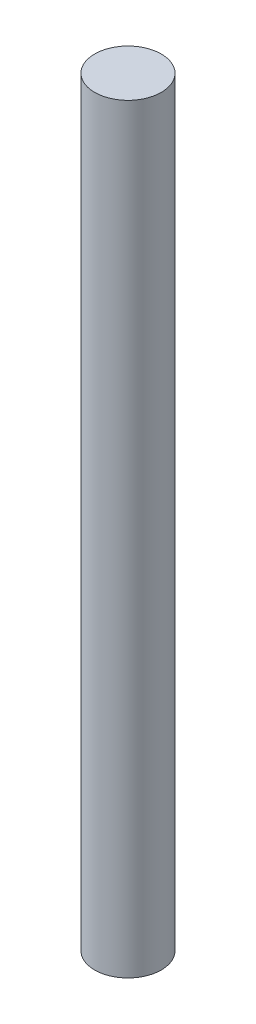
ISO-10303-21;
HEADER;
FILE_DESCRIPTION(('STEP AP214'),'2;1');
FILE_NAME('part.step','',(''),(''),'','','');
FILE_SCHEMA(('AUTOMOTIVE_DESIGN { 1 0 10303 214 1 1 1 1 }'));
ENDSEC;
DATA;
#1=APPLICATION_CONTEXT('core data for automotive mechanical design processes');
#2=APPLICATION_PROTOCOL_DEFINITION('international standard','automotive_design',2000,#1);
#3=PRODUCT_CONTEXT('',#1,'mechanical');
#4=PRODUCT('Part','Part','',(#3));
#5=PRODUCT_RELATED_PRODUCT_CATEGORY('part','',(#4));
#6=PRODUCT_DEFINITION_FORMATION('','',#4);
#7=PRODUCT_DEFINITION_CONTEXT('part definition',#1,'design');
#8=PRODUCT_DEFINITION('design','',#6,#7);
#9=PRODUCT_DEFINITION_SHAPE('','',#8);
#10=(LENGTH_UNIT() NAMED_UNIT(*) SI_UNIT(.MILLI.,.METRE.));
#11=(NAMED_UNIT(*) PLANE_ANGLE_UNIT() SI_UNIT($,.RADIAN.));
#12=(NAMED_UNIT(*) SI_UNIT($,.STERADIAN.) SOLID_ANGLE_UNIT());
#13=UNCERTAINTY_MEASURE_WITH_UNIT(LENGTH_MEASURE(1.E-05),#10,'distance_accuracy_value','');
#14=(GEOMETRIC_REPRESENTATION_CONTEXT(3) GLOBAL_UNCERTAINTY_ASSIGNED_CONTEXT((#13)) GLOBAL_UNIT_ASSIGNED_CONTEXT((#10,
#11,#12)) REPRESENTATION_CONTEXT('',''));
#15=CARTESIAN_POINT('',(0.,0.,0.));
#16=DIRECTION('',(0.,0.,1.));
#17=DIRECTION('',(1.,0.,0.));
#18=AXIS2_PLACEMENT_3D('',#15,#16,#17);
#19=CARTESIAN_POINT('',(0.,290.,0.));
#20=DIRECTION('',(0.,-1.,0.));
#21=DIRECTION('',(0.,0.,-1.));
#22=AXIS2_PLACEMENT_3D('',#19,#20,#21);
#23=CYLINDRICAL_SURFACE('',#22,12.7);
#24=CARTESIAN_POINT('',(0.,290.,0.));
#25=DIRECTION('',(0.,1.,0.));
#26=DIRECTION('',(0.,0.,1.));
#27=AXIS2_PLACEMENT_3D('',#24,#25,#26);
#28=CIRCLE('',#27,12.7);
#29=CARTESIAN_POINT('',(0.,290.,12.7));
#30=VERTEX_POINT('',#29);
#31=EDGE_CURVE('E10',#30,#30,#28,.T.);
#32=ORIENTED_EDGE('',*,*,#31,.F.);
#33=EDGE_LOOP('',(#32));
#34=FACE_BOUND('',#33,.T.);
#35=CARTESIAN_POINT('',(0.,0.,0.));
#36=DIRECTION('',(0.,1.,0.));
#37=DIRECTION('',(0.,0.,1.));
#38=AXIS2_PLACEMENT_3D('',#35,#36,#37);
#39=CIRCLE('',#38,12.7);
#40=CARTESIAN_POINT('',(0.,0.,12.7));
#41=VERTEX_POINT('',#40);
#42=EDGE_CURVE('E33',#41,#41,#39,.T.);
#43=ORIENTED_EDGE('',*,*,#42,.T.);
#44=EDGE_LOOP('',(#43));
#45=FACE_BOUND('',#44,.T.);
#46=ADVANCED_FACE('F30',(#34,#45),#23,.T.);
#47=CARTESIAN_POINT('',(0.,290.,0.));
#48=DIRECTION('',(0.,1.,0.));
#49=DIRECTION('',(0.,0.,1.));
#50=AXIS2_PLACEMENT_3D('',#47,#48,#49);
#51=PLANE('',#50);
#52=ORIENTED_EDGE('',*,*,#31,.T.);
#53=EDGE_LOOP('',(#52));
#54=FACE_BOUND('',#53,.T.);
#55=ADVANCED_FACE('F45',(#54),#51,.T.);
#56=CARTESIAN_POINT('',(0.,0.,0.));
#57=DIRECTION('',(0.,1.,0.));
#58=DIRECTION('',(0.,0.,1.));
#59=AXIS2_PLACEMENT_3D('',#56,#57,#58);
#60=PLANE('',#59);
#61=ORIENTED_EDGE('',*,*,#42,.F.);
#62=EDGE_LOOP('',(#61));
#63=FACE_BOUND('',#62,.T.);
#64=ADVANCED_FACE('F43',(#63),#60,.F.);
#65=CLOSED_SHELL('',(#46,#55,#64));
#66=MANIFOLD_SOLID_BREP('B2',#65);
#67=ADVANCED_BREP_SHAPE_REPRESENTATION('',(#18,#66),#14);
#68=SHAPE_DEFINITION_REPRESENTATION(#9,#67);
ENDSEC;
END-ISO-10303-21;
